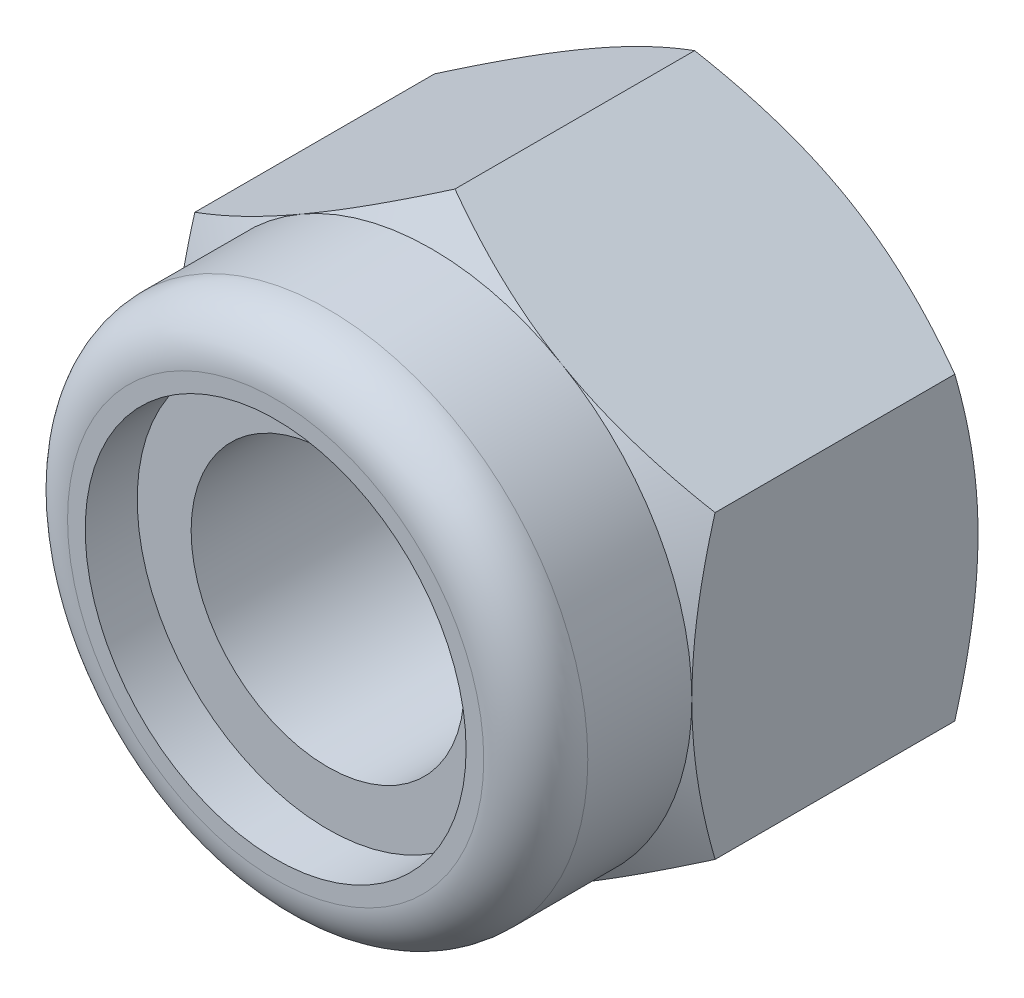
ISO-10303-21;
HEADER;
FILE_DESCRIPTION(('STEP AP214'),'2;1');
FILE_NAME('part.step','',(''),(''),'','','');
FILE_SCHEMA(('AUTOMOTIVE_DESIGN { 1 0 10303 214 1 1 1 1 }'));
ENDSEC;
DATA;
#1=APPLICATION_CONTEXT('core data for automotive mechanical design processes');
#2=APPLICATION_PROTOCOL_DEFINITION('international standard','automotive_design',2000,#1);
#3=PRODUCT_CONTEXT('',#1,'mechanical');
#4=PRODUCT('Part','Part','',(#3));
#5=PRODUCT_RELATED_PRODUCT_CATEGORY('part','',(#4));
#6=PRODUCT_DEFINITION_FORMATION('','',#4);
#7=PRODUCT_DEFINITION_CONTEXT('part definition',#1,'design');
#8=PRODUCT_DEFINITION('design','',#6,#7);
#9=PRODUCT_DEFINITION_SHAPE('','',#8);
#10=(LENGTH_UNIT() NAMED_UNIT(*) SI_UNIT(.MILLI.,.METRE.));
#11=(NAMED_UNIT(*) PLANE_ANGLE_UNIT() SI_UNIT($,.RADIAN.));
#12=(NAMED_UNIT(*) SI_UNIT($,.STERADIAN.) SOLID_ANGLE_UNIT());
#13=UNCERTAINTY_MEASURE_WITH_UNIT(LENGTH_MEASURE(1.E-05),#10,'distance_accuracy_value','');
#14=(GEOMETRIC_REPRESENTATION_CONTEXT(3) GLOBAL_UNCERTAINTY_ASSIGNED_CONTEXT((#13)) GLOBAL_UNIT_ASSIGNED_CONTEXT((#10,
#11,#12)) REPRESENTATION_CONTEXT('',''));
#15=CARTESIAN_POINT('',(0.,0.,0.));
#16=DIRECTION('',(0.,0.,1.));
#17=DIRECTION('',(1.,0.,0.));
#18=AXIS2_PLACEMENT_3D('',#15,#16,#17);
#19=CARTESIAN_POINT('',(0.,0.,-4.4));
#20=DIRECTION('',(0.,0.,1.));
#21=DIRECTION('',(1.,0.,0.));
#22=AXIS2_PLACEMENT_3D('',#19,#20,#21);
#23=CYLINDRICAL_SURFACE('',#22,2.1);
#24=CARTESIAN_POINT('',(0.,0.,1.6));
#25=DIRECTION('',(0.,0.,1.));
#26=DIRECTION('',(1.,0.,0.));
#27=AXIS2_PLACEMENT_3D('',#24,#25,#26);
#28=CIRCLE('',#27,2.1);
#29=CARTESIAN_POINT('',(2.1,0.,1.6));
#30=VERTEX_POINT('',#29);
#31=EDGE_CURVE('E270',#30,#30,#28,.T.);
#32=ORIENTED_EDGE('',*,*,#31,.T.);
#33=EDGE_LOOP('',(#32));
#34=FACE_BOUND('',#33,.T.);
#35=CARTESIAN_POINT('',(0.,0.,-4.09451698471611));
#36=DIRECTION('',(0.,0.,-1.));
#37=DIRECTION('',(-1.,0.,0.));
#38=AXIS2_PLACEMENT_3D('',#35,#36,#37);
#39=CIRCLE('',#38,2.1);
#40=CARTESIAN_POINT('',(-2.1,0.,-4.09451698471611));
#41=VERTEX_POINT('',#40);
#42=EDGE_CURVE('E37',#41,#41,#39,.F.);
#43=ORIENTED_EDGE('',*,*,#42,.F.);
#44=EDGE_LOOP('',(#43));
#45=FACE_BOUND('',#44,.T.);
#46=ADVANCED_FACE('F32',(#34,#45),#23,.F.);
#47=CARTESIAN_POINT('',(0.,4.61880215351702,-4.4));
#48=DIRECTION('',(0.,0.,-1.));
#49=DIRECTION('',(-1.,0.,0.));
#50=AXIS2_PLACEMENT_3D('',#47,#48,#49);
#51=PLANE('',#50);
#52=CARTESIAN_POINT('',(0.,0.,-4.4));
#53=DIRECTION('',(0.,0.,-1.));
#54=DIRECTION('',(-1.,0.,0.));
#55=AXIS2_PLACEMENT_3D('',#52,#53,#54);
#56=CIRCLE('',#55,4.);
#57=CARTESIAN_POINT('',(-4.,0.,-4.4));
#58=VERTEX_POINT('',#57);
#59=CARTESIAN_POINT('',(-2.00000000000002,-3.46410161513774,-4.4));
#60=VERTEX_POINT('',#59);
#61=EDGE_CURVE('E142',#58,#60,#56,.F.);
#62=ORIENTED_EDGE('',*,*,#61,.F.);
#63=CARTESIAN_POINT('',(-2.00000000000001,3.46410161513775,-4.4));
#64=VERTEX_POINT('',#63);
#65=EDGE_CURVE('E232',#64,#58,#56,.F.);
#66=ORIENTED_EDGE('',*,*,#65,.F.);
#67=CARTESIAN_POINT('',(2.00000000000003,3.46410161513774,-4.4));
#68=VERTEX_POINT('',#67);
#69=EDGE_CURVE('E247',#68,#64,#56,.F.);
#70=ORIENTED_EDGE('',*,*,#69,.F.);
#71=CARTESIAN_POINT('',(0.,0.,-4.4));
#72=DIRECTION('',(0.,0.,1.));
#73=DIRECTION('',(1.,0.,0.));
#74=AXIS2_PLACEMENT_3D('',#71,#72,#73);
#75=CIRCLE('',#74,4.);
#76=CARTESIAN_POINT('',(4.,0.,-4.4));
#77=VERTEX_POINT('',#76);
#78=EDGE_CURVE('E204',#77,#68,#75,.T.);
#79=ORIENTED_EDGE('',*,*,#78,.F.);
#80=CARTESIAN_POINT('',(2.00000000000001,-3.46410161513775,-4.4));
#81=VERTEX_POINT('',#80);
#82=EDGE_CURVE('E401',#81,#77,#56,.F.);
#83=ORIENTED_EDGE('',*,*,#82,.F.);
#84=EDGE_CURVE('E319',#60,#81,#56,.F.);
#85=ORIENTED_EDGE('',*,*,#84,.F.);
#86=EDGE_LOOP('',(#62,#66,#70,#79,#83,#85));
#87=FACE_BOUND('',#86,.T.);
#88=CARTESIAN_POINT('',(0.,0.,-4.4));
#89=DIRECTION('',(0.,0.,-1.));
#90=DIRECTION('',(-1.,0.,0.));
#91=AXIS2_PLACEMENT_3D('',#88,#89,#90);
#92=CIRCLE('',#91,2.5);
#93=CARTESIAN_POINT('',(-2.5,0.,-4.4));
#94=VERTEX_POINT('',#93);
#95=EDGE_CURVE('E248',#94,#94,#92,.F.);
#96=ORIENTED_EDGE('',*,*,#95,.T.);
#97=EDGE_LOOP('',(#96));
#98=FACE_BOUND('',#97,.T.);
#99=ADVANCED_FACE('F212',(#87,#98),#51,.T.);
#100=CARTESIAN_POINT('',(0.,4.61880215351702,-4.4));
#101=DIRECTION('',(-0.500000000000002,0.866025403784437,0.));
#102=DIRECTION('',(-0.866025403784437,-0.500000000000002,0.));
#103=AXIS2_PLACEMENT_3D('',#100,#101,#102);
#104=PLANE('',#103);
#105=DIRECTION('',(0.,0.,1.));
#106=VECTOR('',#105,1.);
#107=CARTESIAN_POINT('',(-4.,2.3094010767585,-4.4));
#108=LINE('',#107,#106);
#109=CARTESIAN_POINT('',(-4.,2.30940107675853,-4.04273441009183));
#110=VERTEX_POINT('',#109);
#111=CARTESIAN_POINT('',(-4.,2.3094010767585,-0.357265589908164));
#112=VERTEX_POINT('',#111);
#113=EDGE_CURVE('E243',#110,#112,#108,.T.);
#114=ORIENTED_EDGE('',*,*,#113,.T.);
#115=CARTESIAN_POINT('',(-4.0002,2.30928560670466,-0.357332259074768));
#116=CARTESIAN_POINT('',(-3.82442084967677,2.4107717464617,-0.298717873648283));
#117=CARTESIAN_POINT('',(-3.64712438367362,2.51313390883499,-0.245410321462263));
#118=CARTESIAN_POINT('',(-3.28946140682429,2.71963072479811,-0.152361670746404));
#119=CARTESIAN_POINT('',(-3.10908854102985,2.82376904741904,-0.112653489029705));
#120=CARTESIAN_POINT('',(-2.75057818129721,3.03075510011795,-0.0508422152802794));
#121=CARTESIAN_POINT('',(-2.57249584706486,3.13357098372492,-0.0283277315228888));
#122=CARTESIAN_POINT('',(-2.21549328283349,3.33968651028528,-0.00145062314658178));
#123=CARTESIAN_POINT('',(-2.0365743503559,3.44298540411434,0.00293425857305646));
#124=CARTESIAN_POINT('',(-1.70225715780327,3.63600352522933,-0.00619007293997123));
#125=CARTESIAN_POINT('',(-1.54680884001293,3.72575165335065,-0.0174589539879956));
#126=CARTESIAN_POINT('',(-1.23692494436494,3.90466320392055,-0.053173990798196));
#127=CARTESIAN_POINT('',(-1.08249043825587,3.99382600759479,-0.077632345711537));
#128=CARTESIAN_POINT('',(-0.771967672225417,4.17310641015198,-0.138776064919295));
#129=CARTESIAN_POINT('',(-0.615918711936892,4.26320131938132,-0.17572060365487));
#130=CARTESIAN_POINT('',(-0.306148164596153,4.44204742827552,-0.259570072548035));
#131=CARTESIAN_POINT('',(-0.152422609226213,4.53080091904968,-0.306455302212749));
#132=CARTESIAN_POINT('',(0.000200000000008285,4.61891762357086,-0.357332259074777));
#133=B_SPLINE_CURVE_WITH_KNOTS('',3,(#115,#116,#117,#118,#119,#120,#121,#122,#123,#124,#125,
#126,#127,#128,#129,#130,#131,#132),.UNSPECIFIED.,.F.,.F.,(4,2,2,2,2,2,2,2,4),(0.,
0.634047835695967,1.26961969224543,1.88946157213122,2.50854226669297,3.04757825393386,
3.58711366126904,4.13861653143765,4.68903648037745),.UNSPECIFIED.);
#134=CARTESIAN_POINT('',(-2.00000000000001,3.46410161513775,0.));
#135=VERTEX_POINT('',#134);
#136=EDGE_CURVE('E57',#112,#135,#133,.T.);
#137=ORIENTED_EDGE('',*,*,#136,.T.);
#138=CARTESIAN_POINT('',(0.,4.61880215351702,-0.357265589908173));
#139=VERTEX_POINT('',#138);
#140=EDGE_CURVE('E195',#135,#139,#133,.T.);
#141=ORIENTED_EDGE('',*,*,#140,.T.);
#142=DIRECTION('',(0.,0.,1.));
#143=VECTOR('',#142,1.);
#144=CARTESIAN_POINT('',(0.,4.61880215351702,-4.4));
#145=LINE('',#144,#143);
#146=CARTESIAN_POINT('',(0.,4.61880215351702,-4.04273441009183));
#147=VERTEX_POINT('',#146);
#148=EDGE_CURVE('E229',#147,#139,#145,.T.);
#149=ORIENTED_EDGE('',*,*,#148,.F.);
#150=CARTESIAN_POINT('',(-4.0002,2.30928560670466,-4.04266774092523));
#151=CARTESIAN_POINT('',(-3.82442084967677,2.4107717464617,-4.10128212635172));
#152=CARTESIAN_POINT('',(-3.64712438367362,2.51313390883499,-4.15458967853774));
#153=CARTESIAN_POINT('',(-3.28946140682429,2.71963072479811,-4.2476383292536));
#154=CARTESIAN_POINT('',(-3.10908854102985,2.82376904741904,-4.2873465109703));
#155=CARTESIAN_POINT('',(-2.75057818129721,3.03075510011795,-4.34915778471972));
#156=CARTESIAN_POINT('',(-2.57249584706486,3.13357098372492,-4.37167226847711));
#157=CARTESIAN_POINT('',(-2.21549328283349,3.33968651028528,-4.39854937685342));
#158=CARTESIAN_POINT('',(-2.0365743503559,3.44298540411434,-4.40293425857306));
#159=CARTESIAN_POINT('',(-1.70225715780327,3.63600352522933,-4.39380992706003));
#160=CARTESIAN_POINT('',(-1.54680884001293,3.72575165335065,-4.38254104601201));
#161=CARTESIAN_POINT('',(-1.23692494436494,3.90466320392055,-4.3468260092018));
#162=CARTESIAN_POINT('',(-1.08249043825587,3.99382600759479,-4.32236765428846));
#163=CARTESIAN_POINT('',(-0.771967672225417,4.17310641015198,-4.26122393508071));
#164=CARTESIAN_POINT('',(-0.615918711936892,4.26320131938132,-4.22427939634513));
#165=CARTESIAN_POINT('',(-0.306148164596153,4.44204742827552,-4.14042992745197));
#166=CARTESIAN_POINT('',(-0.152422609226213,4.53080091904968,-4.09354469778725));
#167=CARTESIAN_POINT('',(0.000200000000008277,4.61891762357086,-4.04266774092522));
#168=B_SPLINE_CURVE_WITH_KNOTS('',3,(#150,#151,#152,#153,#154,#155,#156,#157,#158,#159,#160,
#161,#162,#163,#164,#165,#166,#167),.UNSPECIFIED.,.F.,.F.,(4,2,2,2,2,2,2,2,4),(0.,
0.634047835695967,1.26961969224543,1.88946157213122,2.50854226669297,3.04757825393386,
3.58711366126904,4.13861653143765,4.68903648037745),.UNSPECIFIED.);
#169=EDGE_CURVE('E245',#64,#147,#168,.T.);
#170=ORIENTED_EDGE('',*,*,#169,.F.);
#171=EDGE_CURVE('E224',#110,#64,#168,.T.);
#172=ORIENTED_EDGE('',*,*,#171,.F.);
#173=EDGE_LOOP('',(#114,#137,#141,#149,#170,#172));
#174=FACE_BOUND('',#173,.T.);
#175=ADVANCED_FACE('F34',(#174),#104,.T.);
#176=CARTESIAN_POINT('',(4.,2.30940107675848,-4.4));
#177=DIRECTION('',(0.500000000000006,0.866025403784435,0.));
#178=DIRECTION('',(-0.866025403784435,0.500000000000006,0.));
#179=AXIS2_PLACEMENT_3D('',#176,#177,#178);
#180=PLANE('',#179);
#181=ORIENTED_EDGE('',*,*,#148,.T.);
#182=CARTESIAN_POINT('',(-0.000199999999991712,4.61891762357086,-0.357332259074778));
#183=CARTESIAN_POINT('',(0.175579150323236,4.51743148381382,-0.298717873648292));
#184=CARTESIAN_POINT('',(0.352875616326389,4.41506932144053,-0.245410321462271));
#185=CARTESIAN_POINT('',(0.710538593175714,4.2085725054774,-0.152361670746409));
#186=CARTESIAN_POINT('',(0.890911458970159,4.10443418285647,-0.112653489029709));
#187=CARTESIAN_POINT('',(1.2494218187028,3.89744813015756,-0.0508422152802818));
#188=CARTESIAN_POINT('',(1.42750415293515,3.79463224655059,-0.0283277315228907));
#189=CARTESIAN_POINT('',(1.78450671716652,3.58851671999022,-0.00145062314658194));
#190=CARTESIAN_POINT('',(1.96342564964411,3.48521782616116,0.0029342585730574));
#191=CARTESIAN_POINT('',(2.29774284219674,3.29219970504618,-0.00619007293996861));
#192=CARTESIAN_POINT('',(2.45319115998707,3.20245157692485,-0.0174589539879922));
#193=CARTESIAN_POINT('',(2.76307505563506,3.02354002635496,-0.0531739907981903));
#194=CARTESIAN_POINT('',(2.91750956174413,2.93437722268071,-0.0776323457115298));
#195=CARTESIAN_POINT('',(3.22803232777458,2.75509682012352,-0.138776064919286));
#196=CARTESIAN_POINT('',(3.3840812880631,2.66500191089418,-0.17572060365486));
#197=CARTESIAN_POINT('',(3.69385183540384,2.48615580199999,-0.259570072548023));
#198=CARTESIAN_POINT('',(3.84757739077378,2.39740231122583,-0.306455302212736));
#199=CARTESIAN_POINT('',(4.0002,2.30928560670464,-0.357332259074763));
#200=B_SPLINE_CURVE_WITH_KNOTS('',3,(#182,#183,#184,#185,#186,#187,#188,#189,#190,#191,#192,
#193,#194,#195,#196,#197,#198,#199),.UNSPECIFIED.,.F.,.F.,(4,2,2,2,2,2,2,2,4),(0.,
0.634047835695969,1.26961969224544,1.88946157213123,2.50854226669298,3.04757825393387,
3.58711366126904,4.13861653143765,4.68903648037744),.UNSPECIFIED.);
#201=CARTESIAN_POINT('',(2.00000000000002,3.46410161513774,0.));
#202=VERTEX_POINT('',#201);
#203=EDGE_CURVE('E203',#139,#202,#200,.T.);
#204=ORIENTED_EDGE('',*,*,#203,.T.);
#205=CARTESIAN_POINT('',(4.,2.30940107675853,-0.357265589908173));
#206=VERTEX_POINT('',#205);
#207=EDGE_CURVE('E196',#202,#206,#200,.T.);
#208=ORIENTED_EDGE('',*,*,#207,.T.);
#209=DIRECTION('',(0.,0.,1.));
#210=VECTOR('',#209,1.);
#211=CARTESIAN_POINT('',(4.,2.30940107675848,-4.4));
#212=LINE('',#211,#210);
#213=CARTESIAN_POINT('',(4.,2.30940107675853,-4.04273441009183));
#214=VERTEX_POINT('',#213);
#215=EDGE_CURVE('E233',#214,#206,#212,.T.);
#216=ORIENTED_EDGE('',*,*,#215,.F.);
#217=CARTESIAN_POINT('',(-0.000199999999991712,4.61891762357086,-4.04266774092522));
#218=CARTESIAN_POINT('',(0.175579150323236,4.51743148381382,-4.10128212635171));
#219=CARTESIAN_POINT('',(0.352875616326389,4.41506932144053,-4.15458967853773));
#220=CARTESIAN_POINT('',(0.710538593175715,4.2085725054774,-4.24763832925359));
#221=CARTESIAN_POINT('',(0.890911458970159,4.10443418285647,-4.28734651097029));
#222=CARTESIAN_POINT('',(1.2494218187028,3.89744813015756,-4.34915778471972));
#223=CARTESIAN_POINT('',(1.42750415293515,3.79463224655059,-4.37167226847711));
#224=CARTESIAN_POINT('',(1.78450671716652,3.58851671999022,-4.39854937685342));
#225=CARTESIAN_POINT('',(1.96342564964411,3.48521782616116,-4.40293425857306));
#226=CARTESIAN_POINT('',(2.29774284219674,3.29219970504618,-4.39380992706003));
#227=CARTESIAN_POINT('',(2.45319115998707,3.20245157692485,-4.38254104601201));
#228=CARTESIAN_POINT('',(2.76307505563506,3.02354002635496,-4.34682600920181));
#229=CARTESIAN_POINT('',(2.91750956174413,2.93437722268071,-4.32236765428847));
#230=CARTESIAN_POINT('',(3.22803232777458,2.75509682012352,-4.26122393508072));
#231=CARTESIAN_POINT('',(3.3840812880631,2.66500191089418,-4.22427939634514));
#232=CARTESIAN_POINT('',(3.69385183540384,2.48615580199999,-4.14042992745198));
#233=CARTESIAN_POINT('',(3.84757739077378,2.39740231122583,-4.09354469778727));
#234=CARTESIAN_POINT('',(4.0002,2.30928560670464,-4.04266774092524));
#235=B_SPLINE_CURVE_WITH_KNOTS('',3,(#217,#218,#219,#220,#221,#222,#223,#224,#225,#226,#227,
#228,#229,#230,#231,#232,#233,#234),.UNSPECIFIED.,.F.,.F.,(4,2,2,2,2,2,2,2,4),(0.,
0.634047835695969,1.26961969224544,1.88946157213123,2.50854226669298,3.04757825393387,
3.58711366126904,4.13861653143765,4.68903648037744),.UNSPECIFIED.);
#236=EDGE_CURVE('E216',#68,#214,#235,.T.);
#237=ORIENTED_EDGE('',*,*,#236,.F.);
#238=EDGE_CURVE('E222',#147,#68,#235,.T.);
#239=ORIENTED_EDGE('',*,*,#238,.F.);
#240=EDGE_LOOP('',(#181,#204,#208,#216,#237,#239));
#241=FACE_BOUND('',#240,.T.);
#242=ADVANCED_FACE('F206',(#241),#180,.T.);
#243=CARTESIAN_POINT('',(4.,2.30940107675848,-4.4));
#244=DIRECTION('',(-1.,0.,0.));
#245=DIRECTION('',(0.,0.,1.));
#246=AXIS2_PLACEMENT_3D('',#243,#244,#245);
#247=PLANE('',#246);
#248=CARTESIAN_POINT('',(4.,-6.12487198995895,-1.91410682124066));
#249=CARTESIAN_POINT('',(4.,-5.94924937038679,-1.82923627076692));
#250=CARTESIAN_POINT('',(4.,-5.77321152095289,-1.74520940380742));
#251=CARTESIAN_POINT('',(4.,-5.42008084777958,-1.57932514679718));
#252=CARTESIAN_POINT('',(4.,-5.24298784779931,-1.49746813236725));
#253=CARTESIAN_POINT('',(4.,-4.88656571686337,-1.33597446305857));
#254=CARTESIAN_POINT('',(4.,-4.70722958889365,-1.25635319506305));
#255=CARTESIAN_POINT('',(4.,-4.34708334747266,-1.10053058542031));
#256=CARTESIAN_POINT('',(4.,-4.1662733114354,-1.02432906550804));
#257=CARTESIAN_POINT('',(4.,-3.8006470674498,-0.875350650394376));
#258=CARTESIAN_POINT('',(4.,-3.61580892822773,-0.802627284215858));
#259=CARTESIAN_POINT('',(4.,-3.24395246794971,-0.662876230959432));
#260=CARTESIAN_POINT('',(4.,-3.05693390695804,-0.595849177566516));
#261=CARTESIAN_POINT('',(4.,-2.68080318253773,-0.469291748430892));
#262=CARTESIAN_POINT('',(4.,-2.49169643712851,-0.409745434783847));
#263=CARTESIAN_POINT('',(4.,-2.11079454635854,-0.300083356544514));
#264=CARTESIAN_POINT('',(4.,-1.91900027185751,-0.249964609676759));
#265=CARTESIAN_POINT('',(4.,-1.53259232698202,-0.161590794954047));
#266=CARTESIAN_POINT('',(4.,-1.33797792031652,-0.123338885956545));
#267=CARTESIAN_POINT('',(4.,-0.946402725872579,-0.0612742359223471));
#268=CARTESIAN_POINT('',(4.,-0.749441936019798,-0.0374615076517017));
#269=CARTESIAN_POINT('',(4.,-0.355451989627966,-0.00638181314943733));
#270=CARTESIAN_POINT('',(4.,-0.158431311094034,0.000989900761041215));
#271=CARTESIAN_POINT('',(4.,0.235472085607448,-0.00120406637479474));
#272=CARTESIAN_POINT('',(4.,0.432354826312185,-0.0107653508153498));
#273=CARTESIAN_POINT('',(4.,0.768560635225496,-0.040878734613589));
#274=CARTESIAN_POINT('',(4.,0.908254618381798,-0.0575092960439076));
#275=CARTESIAN_POINT('',(4.,1.18656349063495,-0.0982134103466885));
#276=CARTESIAN_POINT('',(4.,1.32517820601011,-0.122288137058443));
#277=CARTESIAN_POINT('',(4.,1.73929045452967,-0.204415070950226));
#278=CARTESIAN_POINT('',(4.,2.01284690528719,-0.272348886425148));
#279=CARTESIAN_POINT('',(4.,2.42218253014521,-0.389516359317196));
#280=CARTESIAN_POINT('',(4.,2.56009536361535,-0.431713941811628));
#281=CARTESIAN_POINT('',(4.,2.834481591014,-0.520284580227753));
#282=CARTESIAN_POINT('',(4.,2.97095590623554,-0.566654756186903));
#283=CARTESIAN_POINT('',(4.,3.24189440516337,-0.662605699180276));
#284=CARTESIAN_POINT('',(4.,3.37636557946834,-0.712166925753489));
#285=CARTESIAN_POINT('',(4.,3.6442646115291,-0.81419835379069));
#286=CARTESIAN_POINT('',(4.,3.77769202239383,-0.866669730963357));
#287=CARTESIAN_POINT('',(4.,3.9106369898668,-0.920309006541779));
#288=B_SPLINE_CURVE_WITH_KNOTS('',3,(#248,#249,#250,#251,#252,#253,#254,#255,#256,#257,#258,
#259,#260,#261,#262,#263,#264,#265,#266,#267,#268,#269,#270,#271,#272,#273,#274,#275,#276,#277,
#278,#279,#280,#281,#282,#283,#284,#285,#286,#287),.UNSPECIFIED.,.F.,.F.,(4,2,2,2,2,2,2,2,2,2,2,
2,2,2,2,2,2,2,2,4),(0.,0.585171792532274,1.17044423059927,1.7590659464599,2.34765694284827,
2.94347400997484,3.5393572721069,4.13394864697601,4.72835161391472,5.32291267067846,
5.91747425310814,6.50823685854038,7.09884609659888,7.52068140825523,7.94258327130841,
8.78701491359831,9.2196528189769,9.65199437116298,10.0819024146297,10.5119854255247),.UNSPECIFIED.);
#289=CARTESIAN_POINT('',(4.,-2.30940107675854,-0.357265589908173));
#290=VERTEX_POINT('',#289);
#291=CARTESIAN_POINT('',(4.,0.,0.));
#292=VERTEX_POINT('',#291);
#293=EDGE_CURVE('E185',#290,#292,#288,.T.);
#294=ORIENTED_EDGE('',*,*,#293,.F.);
#295=DIRECTION('',(0.,0.,1.));
#296=VECTOR('',#295,1.);
#297=CARTESIAN_POINT('',(4.,-2.30940107675853,-4.4));
#298=LINE('',#297,#296);
#299=CARTESIAN_POINT('',(4.,-2.30940107675854,-4.04273441009183));
#300=VERTEX_POINT('',#299);
#301=EDGE_CURVE('E236',#300,#290,#298,.T.);
#302=ORIENTED_EDGE('',*,*,#301,.F.);
#303=CARTESIAN_POINT('',(4.,-6.12487198995895,-2.48589317875934));
#304=CARTESIAN_POINT('',(4.,-5.94924937038679,-2.57076372923308));
#305=CARTESIAN_POINT('',(4.,-5.77321152095289,-2.65479059619258));
#306=CARTESIAN_POINT('',(4.,-5.42008084777958,-2.82067485320282));
#307=CARTESIAN_POINT('',(4.,-5.24298784779931,-2.90253186763275));
#308=CARTESIAN_POINT('',(4.,-4.88656571686337,-3.06402553694143));
#309=CARTESIAN_POINT('',(4.,-4.70722958889365,-3.14364680493695));
#310=CARTESIAN_POINT('',(4.,-4.34708334747266,-3.29946941457969));
#311=CARTESIAN_POINT('',(4.,-4.1662733114354,-3.37567093449197));
#312=CARTESIAN_POINT('',(4.,-3.8006470674498,-3.52464934960562));
#313=CARTESIAN_POINT('',(4.,-3.61580892822773,-3.59737271578414));
#314=CARTESIAN_POINT('',(4.,-3.24395246794971,-3.73712376904057));
#315=CARTESIAN_POINT('',(4.,-3.05693390695804,-3.80415082243349));
#316=CARTESIAN_POINT('',(4.,-2.68080318253773,-3.93070825156911));
#317=CARTESIAN_POINT('',(4.,-2.49169643712851,-3.99025456521615));
#318=CARTESIAN_POINT('',(4.,-2.11079454635854,-4.09991664345549));
#319=CARTESIAN_POINT('',(4.,-1.91900027185751,-4.15003539032324));
#320=CARTESIAN_POINT('',(4.,-1.53259232698202,-4.23840920504595));
#321=CARTESIAN_POINT('',(4.,-1.33797792031652,-4.27666111404346));
#322=CARTESIAN_POINT('',(4.,-0.946402725872579,-4.33872576407765));
#323=CARTESIAN_POINT('',(4.,-0.749441936019798,-4.3625384923483));
#324=CARTESIAN_POINT('',(4.,-0.355451989627965,-4.39361818685056));
#325=CARTESIAN_POINT('',(4.,-0.158431311094033,-4.40098990076104));
#326=CARTESIAN_POINT('',(4.,0.235472085607448,-4.39879593362521));
#327=CARTESIAN_POINT('',(4.,0.432354826312185,-4.38923464918465));
#328=CARTESIAN_POINT('',(4.,0.768560635225496,-4.35912126538641));
#329=CARTESIAN_POINT('',(4.,0.908254618381798,-4.34249070395609));
#330=CARTESIAN_POINT('',(4.,1.18656349063495,-4.30178658965331));
#331=CARTESIAN_POINT('',(4.,1.32517820601011,-4.27771186294156));
#332=CARTESIAN_POINT('',(4.,1.73929045452967,-4.19558492904978));
#333=CARTESIAN_POINT('',(4.,2.01284690528719,-4.12765111357485));
#334=CARTESIAN_POINT('',(4.,2.42218253014521,-4.01048364068281));
#335=CARTESIAN_POINT('',(4.,2.56009536361535,-3.96828605818837));
#336=CARTESIAN_POINT('',(4.,2.834481591014,-3.87971541977225));
#337=CARTESIAN_POINT('',(4.,2.97095590623554,-3.8333452438131));
#338=CARTESIAN_POINT('',(4.,3.24189440516337,-3.73739430081972));
#339=CARTESIAN_POINT('',(4.,3.37636557946834,-3.68783307424651));
#340=CARTESIAN_POINT('',(4.,3.6442646115291,-3.58580164620931));
#341=CARTESIAN_POINT('',(4.,3.77769202239383,-3.53333026903664));
#342=CARTESIAN_POINT('',(4.,3.9106369898668,-3.47969099345822));
#343=B_SPLINE_CURVE_WITH_KNOTS('',3,(#303,#304,#305,#306,#307,#308,#309,#310,#311,#312,#313,
#314,#315,#316,#317,#318,#319,#320,#321,#322,#323,#324,#325,#326,#327,#328,#329,#330,#331,#332,
#333,#334,#335,#336,#337,#338,#339,#340,#341,#342),.UNSPECIFIED.,.F.,.F.,(4,2,2,2,2,2,2,2,2,2,2,
2,2,2,2,2,2,2,2,4),(0.,0.585171792532272,1.17044423059927,1.7590659464599,2.34765694284827,
2.94347400997484,3.5393572721069,4.13394864697601,4.72835161391472,5.32291267067846,
5.91747425310814,6.50823685854038,7.09884609659888,7.52068140825523,7.94258327130841,
8.7870149135983,9.2196528189769,9.65199437116298,10.0819024146297,10.5119854255247),.UNSPECIFIED.);
#344=EDGE_CURVE('E369',#300,#77,#343,.T.);
#345=ORIENTED_EDGE('',*,*,#344,.T.);
#346=EDGE_CURVE('E223',#77,#214,#343,.T.);
#347=ORIENTED_EDGE('',*,*,#346,.T.);
#348=ORIENTED_EDGE('',*,*,#215,.T.);
#349=EDGE_CURVE('E194',#292,#206,#288,.T.);
#350=ORIENTED_EDGE('',*,*,#349,.F.);
#351=EDGE_LOOP('',(#294,#302,#345,#347,#348,#350));
#352=FACE_BOUND('',#351,.T.);
#353=ADVANCED_FACE('F210',(#352),#247,.F.);
#354=CARTESIAN_POINT('',(0.,-4.61880215351705,-4.4));
#355=DIRECTION('',(0.500000000000002,-0.866025403784438,0.));
#356=DIRECTION('',(0.866025403784438,0.500000000000002,0.));
#357=AXIS2_PLACEMENT_3D('',#354,#355,#356);
#358=PLANE('',#357);
#359=ORIENTED_EDGE('',*,*,#301,.T.);
#360=CARTESIAN_POINT('',(4.0002,-2.3092856067047,-0.357332259074778));
#361=CARTESIAN_POINT('',(3.82442084967677,-2.41077174646174,-0.298717873648294));
#362=CARTESIAN_POINT('',(3.64712438367362,-2.51313390883503,-0.245410321462274));
#363=CARTESIAN_POINT('',(3.28946140682429,-2.71963072479815,-0.152361670746416));
#364=CARTESIAN_POINT('',(3.10908854102984,-2.82376904741908,-0.112653489029717));
#365=CARTESIAN_POINT('',(2.75057818129721,-3.03075510011799,-0.050842215280293));
#366=CARTESIAN_POINT('',(2.57249584706485,-3.13357098372496,-0.0283277315229036));
#367=CARTESIAN_POINT('',(2.21549328283348,-3.33968651028532,-0.00145062314659876));
#368=CARTESIAN_POINT('',(2.03657435035589,-3.44298540411438,0.00293425857303859));
#369=CARTESIAN_POINT('',(1.70225715780326,-3.63600352522937,-0.00619007293999064));
#370=CARTESIAN_POINT('',(1.54680884001293,-3.72575165335069,-0.0174589539880155));
#371=CARTESIAN_POINT('',(1.23692494436494,-3.90466320392059,-0.0531739907982159));
#372=CARTESIAN_POINT('',(1.08249043825586,-3.99382600759483,-0.0776323457115564));
#373=CARTESIAN_POINT('',(0.771967672225416,-4.17310641015201,-0.138776064919314));
#374=CARTESIAN_POINT('',(0.615918711936892,-4.26320131938135,-0.175720603654889));
#375=CARTESIAN_POINT('',(0.306148164596155,-4.44204742827555,-0.259570072548054));
#376=CARTESIAN_POINT('',(0.152422609226216,-4.53080091904971,-0.306455302212768));
#377=CARTESIAN_POINT('',(-0.000200000000004476,-4.61891762357089,-0.357332259074796));
#378=B_SPLINE_CURVE_WITH_KNOTS('',3,(#360,#361,#362,#363,#364,#365,#366,#367,#368,#369,#370,
#371,#372,#373,#374,#375,#376,#377),.UNSPECIFIED.,.F.,.F.,(4,2,2,2,2,2,2,2,4),(0.,
0.63404783569597,1.26961969224544,1.88946157213123,2.50854226669298,3.04757825393387,
3.58711366126905,4.13861653143765,4.68903648037744),.UNSPECIFIED.);
#379=CARTESIAN_POINT('',(2.00000000000001,-3.46410161513775,0.));
#380=VERTEX_POINT('',#379);
#381=EDGE_CURVE('E363',#290,#380,#378,.T.);
#382=ORIENTED_EDGE('',*,*,#381,.T.);
#383=CARTESIAN_POINT('',(0.,-4.61880215351702,-0.357265589908173));
#384=VERTEX_POINT('',#383);
#385=EDGE_CURVE('E179',#380,#384,#378,.T.);
#386=ORIENTED_EDGE('',*,*,#385,.T.);
#387=DIRECTION('',(0.,0.,1.));
#388=VECTOR('',#387,1.);
#389=CARTESIAN_POINT('',(0.,-4.61880215351705,-4.4));
#390=LINE('',#389,#388);
#391=CARTESIAN_POINT('',(0.,-4.61880215351702,-4.04273441009183));
#392=VERTEX_POINT('',#391);
#393=EDGE_CURVE('E239',#392,#384,#390,.T.);
#394=ORIENTED_EDGE('',*,*,#393,.F.);
#395=CARTESIAN_POINT('',(4.0002,-2.3092856067047,-4.04266774092522));
#396=CARTESIAN_POINT('',(3.82442084967677,-2.41077174646174,-4.10128212635171));
#397=CARTESIAN_POINT('',(3.64712438367362,-2.51313390883503,-4.15458967853773));
#398=CARTESIAN_POINT('',(3.28946140682429,-2.71963072479815,-4.24763832925359));
#399=CARTESIAN_POINT('',(3.10908854102985,-2.82376904741908,-4.28734651097028));
#400=CARTESIAN_POINT('',(2.7505781812972,-3.03075510011799,-4.34915778471971));
#401=CARTESIAN_POINT('',(2.57249584706485,-3.13357098372496,-4.3716722684771));
#402=CARTESIAN_POINT('',(2.21549328283348,-3.33968651028532,-4.3985493768534));
#403=CARTESIAN_POINT('',(2.03657435035589,-3.44298540411438,-4.40293425857304));
#404=CARTESIAN_POINT('',(1.70225715780326,-3.63600352522937,-4.39380992706001));
#405=CARTESIAN_POINT('',(1.54680884001293,-3.72575165335069,-4.38254104601199));
#406=CARTESIAN_POINT('',(1.23692494436494,-3.90466320392059,-4.34682600920179));
#407=CARTESIAN_POINT('',(1.08249043825586,-3.99382600759483,-4.32236765428845));
#408=CARTESIAN_POINT('',(0.771967672225416,-4.17310641015202,-4.26122393508069));
#409=CARTESIAN_POINT('',(0.615918711936892,-4.26320131938135,-4.22427939634511));
#410=CARTESIAN_POINT('',(0.306148164596155,-4.44204742827555,-4.14042992745195));
#411=CARTESIAN_POINT('',(0.152422609226216,-4.53080091904971,-4.09354469778723));
#412=CARTESIAN_POINT('',(-0.000200000000004484,-4.61891762357089,-4.04266774092521));
#413=B_SPLINE_CURVE_WITH_KNOTS('',3,(#395,#396,#397,#398,#399,#400,#401,#402,#403,#404,#405,
#406,#407,#408,#409,#410,#411,#412),.UNSPECIFIED.,.F.,.F.,(4,2,2,2,2,2,2,2,4),(0.,
0.634047835695969,1.26961969224544,1.88946157213123,2.50854226669298,3.04757825393387,
3.58711366126904,4.13861653143765,4.68903648037744),.UNSPECIFIED.);
#414=EDGE_CURVE('E341',#81,#392,#413,.T.);
#415=ORIENTED_EDGE('',*,*,#414,.F.);
#416=EDGE_CURVE('E365',#300,#81,#413,.T.);
#417=ORIENTED_EDGE('',*,*,#416,.F.);
#418=EDGE_LOOP('',(#359,#382,#386,#394,#415,#417));
#419=FACE_BOUND('',#418,.T.);
#420=ADVANCED_FACE('F348',(#419),#358,.T.);
#421=CARTESIAN_POINT('',(-4.,-2.30940107675852,-4.4));
#422=DIRECTION('',(-0.500000000000005,-0.866025403784436,0.));
#423=DIRECTION('',(0.866025403784436,-0.500000000000005,0.));
#424=AXIS2_PLACEMENT_3D('',#421,#422,#423);
#425=PLANE('',#424);
#426=ORIENTED_EDGE('',*,*,#393,.T.);
#427=CARTESIAN_POINT('',(0.000199999999995994,-4.61891762357089,-0.357332259074796));
#428=CARTESIAN_POINT('',(-0.175579150323233,-4.51743148381385,-0.29871787364831));
#429=CARTESIAN_POINT('',(-0.352875616326388,-4.41506932144056,-0.245410321462289));
#430=CARTESIAN_POINT('',(-0.710538593175716,-4.20857250547743,-0.152361670746426));
#431=CARTESIAN_POINT('',(-0.890911458970162,-4.1044341828565,-0.112653489029725));
#432=CARTESIAN_POINT('',(-1.2494218187028,-3.89744813015759,-0.0508422152802978));
#433=CARTESIAN_POINT('',(-1.42750415293516,-3.79463224655062,-0.0283277315229066));
#434=CARTESIAN_POINT('',(-1.78450671716653,-3.58851671999025,-0.00145062314659826));
#435=CARTESIAN_POINT('',(-1.96342564964412,-3.48521782616119,0.0029342585730408));
#436=CARTESIAN_POINT('',(-2.29774284219675,-3.29219970504621,-0.00619007293998547));
#437=CARTESIAN_POINT('',(-2.45319115998708,-3.20245157692488,-0.0174589539880089));
#438=CARTESIAN_POINT('',(-2.76307505563507,-3.02354002635499,-0.0531739907982064));
#439=CARTESIAN_POINT('',(-2.91750956174414,-2.93437722268074,-0.0776323457115456));
#440=CARTESIAN_POINT('',(-3.22803232777459,-2.75509682012356,-0.138776064919301));
#441=CARTESIAN_POINT('',(-3.38408128806311,-2.66500191089422,-0.175720603654874));
#442=CARTESIAN_POINT('',(-3.69385183540384,-2.48615580200002,-0.259570072548036));
#443=CARTESIAN_POINT('',(-3.84757739077378,-2.39740231122586,-0.306455302212748));
#444=CARTESIAN_POINT('',(-4.0002,-2.30928560670468,-0.357332259074774));
#445=B_SPLINE_CURVE_WITH_KNOTS('',3,(#427,#428,#429,#430,#431,#432,#433,#434,#435,#436,#437,
#438,#439,#440,#441,#442,#443,#444),.UNSPECIFIED.,.F.,.F.,(4,2,2,2,2,2,2,2,4),(0.,
0.634047835695974,1.26961969224545,1.88946157213124,2.508542266693,3.04757825393388,
3.58711366126906,4.13861653143765,4.68903648037744),.UNSPECIFIED.);
#446=CARTESIAN_POINT('',(-2.00000000000002,-3.46410161513774,0.));
#447=VERTEX_POINT('',#446);
#448=EDGE_CURVE('E148',#384,#447,#445,.T.);
#449=ORIENTED_EDGE('',*,*,#448,.T.);
#450=CARTESIAN_POINT('',(-4.,-2.30940107675853,-0.357265589908173));
#451=VERTEX_POINT('',#450);
#452=EDGE_CURVE('E139',#447,#451,#445,.T.);
#453=ORIENTED_EDGE('',*,*,#452,.T.);
#454=DIRECTION('',(0.,0.,1.));
#455=VECTOR('',#454,1.);
#456=CARTESIAN_POINT('',(-4.,-2.30940107675852,-4.4));
#457=LINE('',#456,#455);
#458=CARTESIAN_POINT('',(-4.,-2.30940107675853,-4.04273441009183));
#459=VERTEX_POINT('',#458);
#460=EDGE_CURVE('E147',#459,#451,#457,.T.);
#461=ORIENTED_EDGE('',*,*,#460,.F.);
#462=CARTESIAN_POINT('',(0.000199999999995994,-4.61891762357089,-4.04266774092521));
#463=CARTESIAN_POINT('',(-0.175579150323233,-4.51743148381385,-4.10128212635169));
#464=CARTESIAN_POINT('',(-0.352875616326388,-4.41506932144056,-4.15458967853771));
#465=CARTESIAN_POINT('',(-0.710538593175716,-4.20857250547743,-4.24763832925357));
#466=CARTESIAN_POINT('',(-0.890911458970162,-4.1044341828565,-4.28734651097028));
#467=CARTESIAN_POINT('',(-1.2494218187028,-3.89744813015759,-4.3491577847197));
#468=CARTESIAN_POINT('',(-1.42750415293516,-3.79463224655062,-4.3716722684771));
#469=CARTESIAN_POINT('',(-1.78450671716653,-3.58851671999025,-4.3985493768534));
#470=CARTESIAN_POINT('',(-1.96342564964412,-3.48521782616119,-4.40293425857304));
#471=CARTESIAN_POINT('',(-2.29774284219675,-3.29219970504621,-4.39380992706001));
#472=CARTESIAN_POINT('',(-2.45319115998708,-3.20245157692488,-4.38254104601199));
#473=CARTESIAN_POINT('',(-2.76307505563507,-3.02354002635498,-4.34682600920179));
#474=CARTESIAN_POINT('',(-2.91750956174414,-2.93437722268074,-4.32236765428846));
#475=CARTESIAN_POINT('',(-3.22803232777459,-2.75509682012356,-4.2612239350807));
#476=CARTESIAN_POINT('',(-3.38408128806311,-2.66500191089422,-4.22427939634513));
#477=CARTESIAN_POINT('',(-3.69385183540384,-2.48615580200002,-4.14042992745197));
#478=CARTESIAN_POINT('',(-3.84757739077378,-2.39740231122586,-4.09354469778725));
#479=CARTESIAN_POINT('',(-4.0002,-2.30928560670468,-4.04266774092523));
#480=B_SPLINE_CURVE_WITH_KNOTS('',3,(#462,#463,#464,#465,#466,#467,#468,#469,#470,#471,#472,
#473,#474,#475,#476,#477,#478,#479),.UNSPECIFIED.,.F.,.F.,(4,2,2,2,2,2,2,2,4),(0.,
0.634047835695974,1.26961969224545,1.88946157213124,2.508542266693,3.04757825393388,
3.58711366126906,4.13861653143765,4.68903648037744),.UNSPECIFIED.);
#481=EDGE_CURVE('E330',#60,#459,#480,.T.);
#482=ORIENTED_EDGE('',*,*,#481,.F.);
#483=EDGE_CURVE('E340',#392,#60,#480,.T.);
#484=ORIENTED_EDGE('',*,*,#483,.F.);
#485=EDGE_LOOP('',(#426,#449,#453,#461,#482,#484));
#486=FACE_BOUND('',#485,.T.);
#487=ADVANCED_FACE('F345',(#486),#425,.T.);
#488=CARTESIAN_POINT('',(-4.,2.3094010767585,-4.4));
#489=DIRECTION('',(-1.,0.,0.));
#490=DIRECTION('',(0.,0.,1.));
#491=AXIS2_PLACEMENT_3D('',#488,#489,#490);
#492=PLANE('',#491);
#493=ORIENTED_EDGE('',*,*,#460,.T.);
#494=CARTESIAN_POINT('',(-4.,-6.12487198995894,-1.91410682124065));
#495=CARTESIAN_POINT('',(-4.,-5.94924937038678,-1.82923627076691));
#496=CARTESIAN_POINT('',(-4.,-5.77321152095288,-1.74520940380741));
#497=CARTESIAN_POINT('',(-4.,-5.42008084777956,-1.57932514679718));
#498=CARTESIAN_POINT('',(-4.,-5.24298784779929,-1.49746813236724));
#499=CARTESIAN_POINT('',(-4.,-4.88656571686335,-1.33597446305857));
#500=CARTESIAN_POINT('',(-4.,-4.70722958889364,-1.25635319506305));
#501=CARTESIAN_POINT('',(-4.,-4.34708334747265,-1.10053058542031));
#502=CARTESIAN_POINT('',(-4.,-4.16627331143539,-1.02432906550803));
#503=CARTESIAN_POINT('',(-4.,-3.80064706744979,-0.87535065039437));
#504=CARTESIAN_POINT('',(-4.,-3.61580892822771,-0.802627284215852));
#505=CARTESIAN_POINT('',(-4.,-3.2439524679497,-0.662876230959426));
#506=CARTESIAN_POINT('',(-4.,-3.05693390695802,-0.59584917756651));
#507=CARTESIAN_POINT('',(-4.,-2.68080318253772,-0.469291748430887));
#508=CARTESIAN_POINT('',(-4.,-2.4916964371285,-0.409745434783842));
#509=CARTESIAN_POINT('',(-4.,-2.11079454635852,-0.30008335654451));
#510=CARTESIAN_POINT('',(-4.,-1.9190002718575,-0.249964609676756));
#511=CARTESIAN_POINT('',(-4.,-1.53259232698201,-0.161590794954045));
#512=CARTESIAN_POINT('',(-4.,-1.33797792031651,-0.123338885956542));
#513=CARTESIAN_POINT('',(-4.,-0.946402725872565,-0.0612742359223449));
#514=CARTESIAN_POINT('',(-4.,-0.749441936019784,-0.0374615076517001));
#515=CARTESIAN_POINT('',(-4.,-0.355451989627953,-0.00638181314943691));
#516=CARTESIAN_POINT('',(-4.,-0.158431311094021,0.000989900761041009));
#517=CARTESIAN_POINT('',(-4.,0.23547208560746,-0.00120406637479554));
#518=CARTESIAN_POINT('',(-4.,0.432354826312197,-0.0107653508153505));
#519=CARTESIAN_POINT('',(-4.,0.768560635225508,-0.0408787346135903));
#520=CARTESIAN_POINT('',(-4.,0.90825461838181,-0.0575092960439092));
#521=CARTESIAN_POINT('',(-4.,1.18656349063496,-0.0982134103466909));
#522=CARTESIAN_POINT('',(-4.,1.32517820601012,-0.122288137058445));
#523=CARTESIAN_POINT('',(-4.,1.73929045452968,-0.204415070950229));
#524=CARTESIAN_POINT('',(-4.,2.01284690528721,-0.272348886425151));
#525=CARTESIAN_POINT('',(-4.,2.42218253014522,-0.389516359317201));
#526=CARTESIAN_POINT('',(-4.,2.56009536361537,-0.431713941811633));
#527=CARTESIAN_POINT('',(-4.,2.83448159101402,-0.520284580227759));
#528=CARTESIAN_POINT('',(-4.,2.97095590623556,-0.566654756186909));
#529=CARTESIAN_POINT('',(-4.,3.24189440516339,-0.662605699180283));
#530=CARTESIAN_POINT('',(-4.,3.37636557946836,-0.712166925753496));
#531=CARTESIAN_POINT('',(-4.,3.64426461152912,-0.814198353790697));
#532=CARTESIAN_POINT('',(-4.,3.77769202239385,-0.866669730963364));
#533=CARTESIAN_POINT('',(-4.,3.91063698986682,-0.920309006541787));
#534=B_SPLINE_CURVE_WITH_KNOTS('',3,(#494,#495,#496,#497,#498,#499,#500,#501,#502,#503,#504,
#505,#506,#507,#508,#509,#510,#511,#512,#513,#514,#515,#516,#517,#518,#519,#520,#521,#522,#523,
#524,#525,#526,#527,#528,#529,#530,#531,#532,#533),.UNSPECIFIED.,.F.,.F.,(4,2,2,2,2,2,2,2,2,2,2,
2,2,2,2,2,2,2,2,4),(0.,0.585171792532271,1.17044423059927,1.7590659464599,2.34765694284827,
2.94347400997484,3.5393572721069,4.13394864697601,4.72835161391472,5.32291267067846,
5.91747425310814,6.50823685854038,7.09884609659887,7.52068140825522,7.9425832713084,
8.7870149135983,9.2196528189769,9.65199437116298,10.0819024146297,10.5119854255247),.UNSPECIFIED.);
#535=CARTESIAN_POINT('',(-4.,0.,0.));
#536=VERTEX_POINT('',#535);
#537=EDGE_CURVE('E132',#451,#536,#534,.T.);
#538=ORIENTED_EDGE('',*,*,#537,.T.);
#539=EDGE_CURVE('E126',#536,#112,#534,.T.);
#540=ORIENTED_EDGE('',*,*,#539,.T.);
#541=ORIENTED_EDGE('',*,*,#113,.F.);
#542=CARTESIAN_POINT('',(-4.,-6.12487198995894,-2.48589317875935));
#543=CARTESIAN_POINT('',(-4.,-5.94924937038678,-2.57076372923309));
#544=CARTESIAN_POINT('',(-4.,-5.77321152095288,-2.65479059619259));
#545=CARTESIAN_POINT('',(-4.,-5.42008084777956,-2.82067485320282));
#546=CARTESIAN_POINT('',(-4.,-5.24298784779929,-2.90253186763276));
#547=CARTESIAN_POINT('',(-4.,-4.88656571686336,-3.06402553694143));
#548=CARTESIAN_POINT('',(-4.,-4.70722958889364,-3.14364680493695));
#549=CARTESIAN_POINT('',(-4.,-4.34708334747265,-3.29946941457969));
#550=CARTESIAN_POINT('',(-4.,-4.16627331143539,-3.37567093449197));
#551=CARTESIAN_POINT('',(-4.,-3.80064706744979,-3.52464934960563));
#552=CARTESIAN_POINT('',(-4.,-3.61580892822771,-3.59737271578415));
#553=CARTESIAN_POINT('',(-4.,-3.2439524679497,-3.73712376904057));
#554=CARTESIAN_POINT('',(-4.,-3.05693390695803,-3.80415082243349));
#555=CARTESIAN_POINT('',(-4.,-2.68080318253772,-3.93070825156911));
#556=CARTESIAN_POINT('',(-4.,-2.4916964371285,-3.99025456521616));
#557=CARTESIAN_POINT('',(-4.,-2.11079454635852,-4.09991664345549));
#558=CARTESIAN_POINT('',(-4.,-1.9190002718575,-4.15003539032324));
#559=CARTESIAN_POINT('',(-4.,-1.53259232698201,-4.23840920504596));
#560=CARTESIAN_POINT('',(-4.,-1.33797792031651,-4.27666111404346));
#561=CARTESIAN_POINT('',(-4.,-0.946402725872566,-4.33872576407766));
#562=CARTESIAN_POINT('',(-4.,-0.749441936019785,-4.3625384923483));
#563=CARTESIAN_POINT('',(-4.,-0.355451989627953,-4.39361818685056));
#564=CARTESIAN_POINT('',(-4.,-0.158431311094022,-4.40098990076104));
#565=CARTESIAN_POINT('',(-4.,0.235472085607459,-4.39879593362521));
#566=CARTESIAN_POINT('',(-4.,0.432354826312196,-4.38923464918465));
#567=CARTESIAN_POINT('',(-4.,0.768560635225507,-4.35912126538641));
#568=CARTESIAN_POINT('',(-4.,0.90825461838181,-4.34249070395609));
#569=CARTESIAN_POINT('',(-4.,1.18656349063496,-4.30178658965331));
#570=CARTESIAN_POINT('',(-4.,1.32517820601012,-4.27771186294156));
#571=CARTESIAN_POINT('',(-4.,1.73929045452968,-4.19558492904977));
#572=CARTESIAN_POINT('',(-4.,2.01284690528721,-4.12765111357485));
#573=CARTESIAN_POINT('',(-4.,2.42218253014522,-4.0104836406828));
#574=CARTESIAN_POINT('',(-4.,2.56009536361537,-3.96828605818837));
#575=CARTESIAN_POINT('',(-4.,2.83448159101402,-3.87971541977224));
#576=CARTESIAN_POINT('',(-4.,2.97095590623556,-3.83334524381309));
#577=CARTESIAN_POINT('',(-4.,3.24189440516339,-3.73739430081972));
#578=CARTESIAN_POINT('',(-4.,3.37636557946836,-3.68783307424651));
#579=CARTESIAN_POINT('',(-4.,3.64426461152912,-3.5858016462093));
#580=CARTESIAN_POINT('',(-4.,3.77769202239385,-3.53333026903664));
#581=CARTESIAN_POINT('',(-4.,3.91063698986682,-3.47969099345821));
#582=B_SPLINE_CURVE_WITH_KNOTS('',3,(#542,#543,#544,#545,#546,#547,#548,#549,#550,#551,#552,
#553,#554,#555,#556,#557,#558,#559,#560,#561,#562,#563,#564,#565,#566,#567,#568,#569,#570,#571,
#572,#573,#574,#575,#576,#577,#578,#579,#580,#581),.UNSPECIFIED.,.F.,.F.,(4,2,2,2,2,2,2,2,2,2,2,
2,2,2,2,2,2,2,2,4),(0.,0.585171792532271,1.17044423059927,1.7590659464599,2.34765694284827,
2.94347400997484,3.53935727210689,4.13394864697601,4.72835161391472,5.32291267067846,
5.91747425310814,6.50823685854038,7.09884609659888,7.52068140825522,7.9425832713084,
8.7870149135983,9.2196528189769,9.65199437116298,10.0819024146297,10.5119854255247),.UNSPECIFIED.);
#583=EDGE_CURVE('E327',#58,#110,#582,.T.);
#584=ORIENTED_EDGE('',*,*,#583,.F.);
#585=EDGE_CURVE('E329',#459,#58,#582,.T.);
#586=ORIENTED_EDGE('',*,*,#585,.F.);
#587=EDGE_LOOP('',(#493,#538,#540,#541,#584,#586));
#588=FACE_BOUND('',#587,.T.);
#589=ADVANCED_FACE('F144',(#588),#492,.T.);
#590=CARTESIAN_POINT('',(0.,0.,-4.4));
#591=DIRECTION('',(0.,0.,1.));
#592=DIRECTION('',(1.,0.,0.));
#593=AXIS2_PLACEMENT_3D('',#590,#591,#592);
#594=CONICAL_SURFACE('',#593,4.,1.0471975511966);
#595=ORIENTED_EDGE('',*,*,#171,.T.);
#596=ORIENTED_EDGE('',*,*,#65,.T.);
#597=ORIENTED_EDGE('',*,*,#583,.T.);
#598=EDGE_LOOP('',(#595,#596,#597));
#599=FACE_BOUND('',#598,.T.);
#600=ADVANCED_FACE('F325',(#599),#594,.T.);
#601=ORIENTED_EDGE('',*,*,#169,.T.);
#602=ORIENTED_EDGE('',*,*,#238,.T.);
#603=ORIENTED_EDGE('',*,*,#69,.T.);
#604=EDGE_LOOP('',(#601,#602,#603));
#605=FACE_BOUND('',#604,.T.);
#606=ADVANCED_FACE('F399',(#605),#594,.T.);
#607=ORIENTED_EDGE('',*,*,#236,.T.);
#608=ORIENTED_EDGE('',*,*,#346,.F.);
#609=ORIENTED_EDGE('',*,*,#78,.T.);
#610=EDGE_LOOP('',(#607,#608,#609));
#611=FACE_BOUND('',#610,.T.);
#612=ADVANCED_FACE('F403',(#611),#594,.T.);
#613=ORIENTED_EDGE('',*,*,#416,.T.);
#614=ORIENTED_EDGE('',*,*,#82,.T.);
#615=ORIENTED_EDGE('',*,*,#344,.F.);
#616=EDGE_LOOP('',(#613,#614,#615));
#617=FACE_BOUND('',#616,.T.);
#618=ADVANCED_FACE('F402',(#617),#594,.T.);
#619=ORIENTED_EDGE('',*,*,#414,.T.);
#620=ORIENTED_EDGE('',*,*,#483,.T.);
#621=ORIENTED_EDGE('',*,*,#84,.T.);
#622=EDGE_LOOP('',(#619,#620,#621));
#623=FACE_BOUND('',#622,.T.);
#624=ADVANCED_FACE('F389',(#623),#594,.T.);
#625=ORIENTED_EDGE('',*,*,#481,.T.);
#626=ORIENTED_EDGE('',*,*,#585,.T.);
#627=ORIENTED_EDGE('',*,*,#61,.T.);
#628=EDGE_LOOP('',(#625,#626,#627));
#629=FACE_BOUND('',#628,.T.);
#630=ADVANCED_FACE('F167',(#629),#594,.T.);
#631=CARTESIAN_POINT('',(0.,0.,0.));
#632=DIRECTION('',(0.,0.,-1.));
#633=DIRECTION('',(-1.,0.,0.));
#634=AXIS2_PLACEMENT_3D('',#631,#632,#633);
#635=CONICAL_SURFACE('',#634,4.,1.0471975511966);
#636=CARTESIAN_POINT('',(0.,0.,0.));
#637=DIRECTION('',(0.,0.,-1.));
#638=DIRECTION('',(-1.,0.,0.));
#639=AXIS2_PLACEMENT_3D('',#636,#637,#638);
#640=CIRCLE('',#639,4.);
#641=EDGE_CURVE('E44',#447,#536,#640,.T.);
#642=ORIENTED_EDGE('',*,*,#641,.T.);
#643=ORIENTED_EDGE('',*,*,#537,.F.);
#644=ORIENTED_EDGE('',*,*,#452,.F.);
#645=EDGE_LOOP('',(#642,#643,#644));
#646=FACE_BOUND('',#645,.T.);
#647=ADVANCED_FACE('F137',(#646),#635,.T.);
#648=EDGE_CURVE('E141',#380,#447,#640,.T.);
#649=ORIENTED_EDGE('',*,*,#648,.T.);
#650=ORIENTED_EDGE('',*,*,#448,.F.);
#651=ORIENTED_EDGE('',*,*,#385,.F.);
#652=EDGE_LOOP('',(#649,#650,#651));
#653=FACE_BOUND('',#652,.T.);
#654=ADVANCED_FACE('F166',(#653),#635,.T.);
#655=ORIENTED_EDGE('',*,*,#293,.T.);
#656=EDGE_CURVE('E393',#292,#380,#640,.T.);
#657=ORIENTED_EDGE('',*,*,#656,.T.);
#658=ORIENTED_EDGE('',*,*,#381,.F.);
#659=EDGE_LOOP('',(#655,#657,#658));
#660=FACE_BOUND('',#659,.T.);
#661=ADVANCED_FACE('F519',(#660),#635,.T.);
#662=CARTESIAN_POINT('',(0.,0.,0.));
#663=DIRECTION('',(0.,0.,1.));
#664=DIRECTION('',(1.,0.,0.));
#665=AXIS2_PLACEMENT_3D('',#662,#663,#664);
#666=CIRCLE('',#665,4.);
#667=EDGE_CURVE('E133',#292,#202,#666,.T.);
#668=ORIENTED_EDGE('',*,*,#667,.F.);
#669=ORIENTED_EDGE('',*,*,#349,.T.);
#670=ORIENTED_EDGE('',*,*,#207,.F.);
#671=EDGE_LOOP('',(#668,#669,#670));
#672=FACE_BOUND('',#671,.T.);
#673=ADVANCED_FACE('F377',(#672),#635,.T.);
#674=EDGE_CURVE('E42',#135,#202,#640,.T.);
#675=ORIENTED_EDGE('',*,*,#674,.T.);
#676=ORIENTED_EDGE('',*,*,#203,.F.);
#677=ORIENTED_EDGE('',*,*,#140,.F.);
#678=EDGE_LOOP('',(#675,#676,#677));
#679=FACE_BOUND('',#678,.T.);
#680=ADVANCED_FACE('F168',(#679),#635,.T.);
#681=ORIENTED_EDGE('',*,*,#539,.F.);
#682=EDGE_CURVE('E11',#536,#135,#640,.T.);
#683=ORIENTED_EDGE('',*,*,#682,.T.);
#684=ORIENTED_EDGE('',*,*,#136,.F.);
#685=EDGE_LOOP('',(#681,#683,#684));
#686=FACE_BOUND('',#685,.T.);
#687=ADVANCED_FACE('F127',(#686),#635,.T.);
#688=CARTESIAN_POINT('',(0.,0.,-4.3746));
#689=DIRECTION('',(0.,0.,-1.));
#690=DIRECTION('',(-1.,0.,0.));
#691=AXIS2_PLACEMENT_3D('',#688,#689,#690);
#692=CONICAL_SURFACE('',#691,2.5,0.959931088596878);
#693=CARTESIAN_POINT('',(0.,0.,-4.3746));
#694=DIRECTION('',(0.,0.,1.));
#695=DIRECTION('',(1.,0.,0.));
#696=AXIS2_PLACEMENT_3D('',#693,#694,#695);
#697=CIRCLE('',#696,2.5);
#698=CARTESIAN_POINT('',(2.5,0.,-4.3746));
#699=VERTEX_POINT('',#698);
#700=EDGE_CURVE('E250',#699,#699,#697,.T.);
#701=ORIENTED_EDGE('',*,*,#700,.F.);
#702=EDGE_LOOP('',(#701));
#703=FACE_BOUND('',#702,.T.);
#704=ORIENTED_EDGE('',*,*,#42,.T.);
#705=EDGE_LOOP('',(#704));
#706=FACE_BOUND('',#705,.T.);
#707=ADVANCED_FACE('F485',(#703,#706),#692,.F.);
#708=CARTESIAN_POINT('',(0.,0.,-25.0375057290932));
#709=DIRECTION('',(0.,0.,1.));
#710=DIRECTION('',(1.,0.,0.));
#711=AXIS2_PLACEMENT_3D('',#708,#709,#710);
#712=CYLINDRICAL_SURFACE('',#711,2.5);
#713=ORIENTED_EDGE('',*,*,#95,.F.);
#714=EDGE_LOOP('',(#713));
#715=FACE_BOUND('',#714,.T.);
#716=ORIENTED_EDGE('',*,*,#700,.T.);
#717=EDGE_LOOP('',(#716));
#718=FACE_BOUND('',#717,.T.);
#719=ADVANCED_FACE('F169',(#715,#718),#712,.F.);
#720=CARTESIAN_POINT('',(0.,2.1,1.6));
#721=DIRECTION('',(0.,0.,-1.));
#722=DIRECTION('',(-1.,0.,0.));
#723=AXIS2_PLACEMENT_3D('',#720,#721,#722);
#724=PLANE('',#723);
#725=ORIENTED_EDGE('',*,*,#31,.F.);
#726=EDGE_LOOP('',(#725));
#727=FACE_BOUND('',#726,.T.);
#728=CARTESIAN_POINT('',(0.,0.,1.6));
#729=DIRECTION('',(0.,0.,1.));
#730=DIRECTION('',(1.,0.,0.));
#731=AXIS2_PLACEMENT_3D('',#728,#729,#730);
#732=CIRCLE('',#731,2.92857142857143);
#733=CARTESIAN_POINT('',(2.92857142857143,0.,1.6));
#734=VERTEX_POINT('',#733);
#735=EDGE_CURVE('E255',#734,#734,#732,.T.);
#736=ORIENTED_EDGE('',*,*,#735,.T.);
#737=EDGE_LOOP('',(#736));
#738=FACE_BOUND('',#737,.T.);
#739=ADVANCED_FACE('F276',(#727,#738),#724,.F.);
#740=CARTESIAN_POINT('',(0.,0.,9.48088822457563));
#741=DIRECTION('',(0.,0.,1.));
#742=DIRECTION('',(1.,0.,0.));
#743=AXIS2_PLACEMENT_3D('',#740,#741,#742);
#744=CYLINDRICAL_SURFACE('',#743,2.92857142857143);
#745=ORIENTED_EDGE('',*,*,#735,.F.);
#746=EDGE_LOOP('',(#745));
#747=FACE_BOUND('',#746,.T.);
#748=CARTESIAN_POINT('',(0.,0.,2.4));
#749=DIRECTION('',(0.,0.,1.));
#750=DIRECTION('',(1.,0.,0.));
#751=AXIS2_PLACEMENT_3D('',#748,#749,#750);
#752=CIRCLE('',#751,2.92857142857143);
#753=CARTESIAN_POINT('',(2.92857142857143,0.,2.4));
#754=VERTEX_POINT('',#753);
#755=EDGE_CURVE('E259',#754,#754,#752,.T.);
#756=ORIENTED_EDGE('',*,*,#755,.T.);
#757=EDGE_LOOP('',(#756));
#758=FACE_BOUND('',#757,.T.);
#759=ADVANCED_FACE('F279',(#747,#758),#744,.F.);
#760=CARTESIAN_POINT('',(0.,2.92857142857143,2.4));
#761=DIRECTION('',(0.,0.,-1.));
#762=DIRECTION('',(-1.,0.,0.));
#763=AXIS2_PLACEMENT_3D('',#760,#761,#762);
#764=PLANE('',#763);
#765=ORIENTED_EDGE('',*,*,#755,.F.);
#766=EDGE_LOOP('',(#765));
#767=FACE_BOUND('',#766,.T.);
#768=CARTESIAN_POINT('',(0.,0.,2.4));
#769=DIRECTION('',(0.,0.,1.));
#770=DIRECTION('',(1.,0.,0.));
#771=AXIS2_PLACEMENT_3D('',#768,#769,#770);
#772=CIRCLE('',#771,3.2);
#773=CARTESIAN_POINT('',(3.2,0.,2.4));
#774=VERTEX_POINT('',#773);
#775=EDGE_CURVE('E264',#774,#774,#772,.T.);
#776=ORIENTED_EDGE('',*,*,#775,.T.);
#777=EDGE_LOOP('',(#776));
#778=FACE_BOUND('',#777,.T.);
#779=ADVANCED_FACE('F285',(#767,#778),#764,.F.);
#780=CARTESIAN_POINT('',(0.,0.,1.6));
#781=DIRECTION('',(0.,0.,1.));
#782=DIRECTION('',(1.,0.,0.));
#783=AXIS2_PLACEMENT_3D('',#780,#781,#782);
#784=TOROIDAL_SURFACE('',#783,3.2,0.799999999999999);
#785=ORIENTED_EDGE('',*,*,#775,.F.);
#786=EDGE_LOOP('',(#785));
#787=FACE_BOUND('',#786,.T.);
#788=CARTESIAN_POINT('',(0.,0.,1.59999999999999));
#789=DIRECTION('',(0.,0.,1.));
#790=DIRECTION('',(1.,0.,0.));
#791=AXIS2_PLACEMENT_3D('',#788,#789,#790);
#792=CIRCLE('',#791,4.);
#793=CARTESIAN_POINT('',(4.,0.,1.59999999999999));
#794=VERTEX_POINT('',#793);
#795=EDGE_CURVE('E267',#794,#794,#792,.T.);
#796=ORIENTED_EDGE('',*,*,#795,.T.);
#797=EDGE_LOOP('',(#796));
#798=FACE_BOUND('',#797,.T.);
#799=ADVANCED_FACE('F291',(#787,#798),#784,.T.);
#800=CARTESIAN_POINT('',(0.,0.,9.48088822457563));
#801=DIRECTION('',(0.,0.,1.));
#802=DIRECTION('',(1.,0.,0.));
#803=AXIS2_PLACEMENT_3D('',#800,#801,#802);
#804=CYLINDRICAL_SURFACE('',#803,4.);
#805=ORIENTED_EDGE('',*,*,#641,.F.);
#806=ORIENTED_EDGE('',*,*,#648,.F.);
#807=ORIENTED_EDGE('',*,*,#656,.F.);
#808=ORIENTED_EDGE('',*,*,#667,.T.);
#809=ORIENTED_EDGE('',*,*,#674,.F.);
#810=ORIENTED_EDGE('',*,*,#682,.F.);
#811=EDGE_LOOP('',(#805,#806,#807,#808,#809,#810));
#812=FACE_BOUND('',#811,.T.);
#813=ORIENTED_EDGE('',*,*,#795,.F.);
#814=EDGE_LOOP('',(#813));
#815=FACE_BOUND('',#814,.T.);
#816=ADVANCED_FACE('F122',(#812,#815),#804,.T.);
#817=CLOSED_SHELL('',(#46,#99,#175,#242,#353,#420,#487,#589,#600,#606,#612,#618,#624,#630,#647,
#654,#661,#673,#680,#687,#707,#719,#739,#759,#779,#799,#816));
#818=MANIFOLD_SOLID_BREP('B2',#817);
#819=ADVANCED_BREP_SHAPE_REPRESENTATION('',(#18,#818),#14);
#820=SHAPE_DEFINITION_REPRESENTATION(#9,#819);
ENDSEC;
END-ISO-10303-21;
